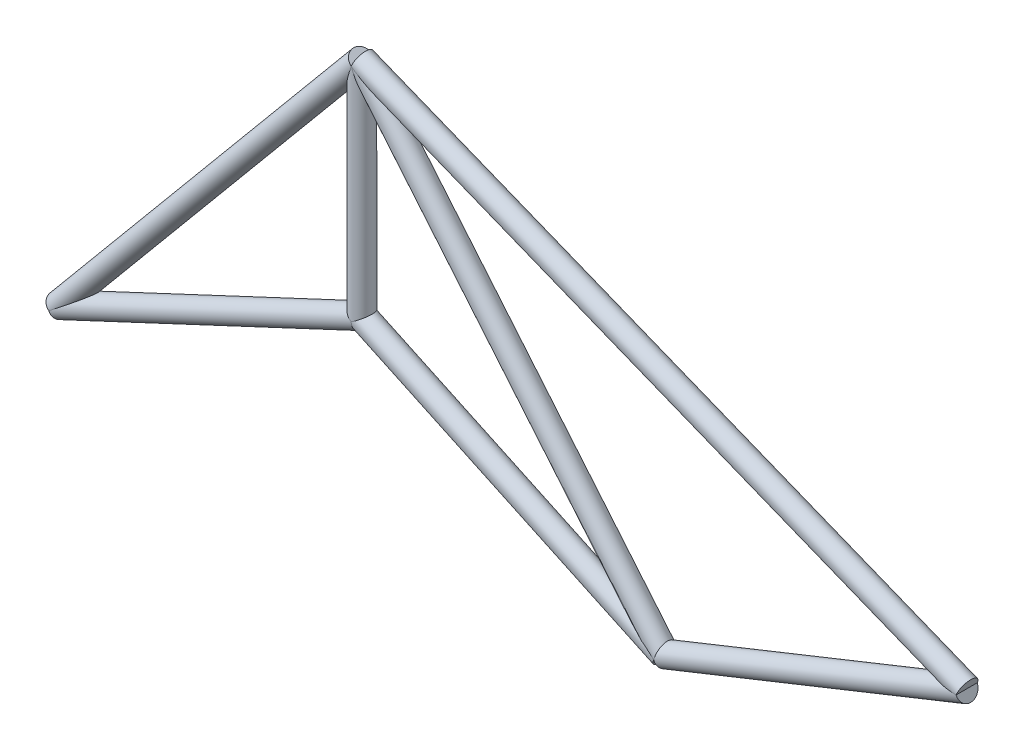
ISO-10303-21;
HEADER;
FILE_DESCRIPTION(('STEP AP214'),'2;1');
FILE_NAME('part.step','',(''),(''),'','','');
FILE_SCHEMA(('AUTOMOTIVE_DESIGN { 1 0 10303 214 1 1 1 1 }'));
ENDSEC;
DATA;
#1=APPLICATION_CONTEXT('core data for automotive mechanical design processes');
#2=APPLICATION_PROTOCOL_DEFINITION('international standard','automotive_design',2000,#1);
#3=PRODUCT_CONTEXT('',#1,'mechanical');
#4=PRODUCT('Part','Part','',(#3));
#5=PRODUCT_RELATED_PRODUCT_CATEGORY('part','',(#4));
#6=PRODUCT_DEFINITION_FORMATION('','',#4);
#7=PRODUCT_DEFINITION_CONTEXT('part definition',#1,'design');
#8=PRODUCT_DEFINITION('design','',#6,#7);
#9=PRODUCT_DEFINITION_SHAPE('','',#8);
#10=(LENGTH_UNIT() NAMED_UNIT(*) SI_UNIT(.MILLI.,.METRE.));
#11=(NAMED_UNIT(*) PLANE_ANGLE_UNIT() SI_UNIT($,.RADIAN.));
#12=(NAMED_UNIT(*) SI_UNIT($,.STERADIAN.) SOLID_ANGLE_UNIT());
#13=UNCERTAINTY_MEASURE_WITH_UNIT(LENGTH_MEASURE(1.E-05),#10,'distance_accuracy_value','');
#14=(GEOMETRIC_REPRESENTATION_CONTEXT(3) GLOBAL_UNCERTAINTY_ASSIGNED_CONTEXT((#13)) GLOBAL_UNIT_ASSIGNED_CONTEXT((#10,
#11,#12)) REPRESENTATION_CONTEXT('',''));
#15=CARTESIAN_POINT('',(0.,0.,0.));
#16=DIRECTION('',(0.,0.,1.));
#17=DIRECTION('',(1.,0.,0.));
#18=AXIS2_PLACEMENT_3D('',#15,#16,#17);
#19=CARTESIAN_POINT('',(2540.,1189.67236280048,0.));
#20=DIRECTION('',(0.,1.,0.));
#21=DIRECTION('',(-1.,0.,0.));
#22=AXIS2_PLACEMENT_3D('',#19,#20,#21);
#23=CYLINDRICAL_SURFACE('',#22,88.9);
#24=CARTESIAN_POINT('',(2540.,3048.,0.));
#25=DIRECTION('',(0.828067230469273,0.560628809305184,0.));
#26=DIRECTION('',(-0.560628809305184,0.828067230469273,0.));
#27=AXIS2_PLACEMENT_3D('',#24,#25,#26);
#28=ELLIPSE('',#27,158.571943725436,88.9);
#29=CARTESIAN_POINT('',(2540.,3048.,88.9));
#30=VERTEX_POINT('',#29);
#31=CARTESIAN_POINT('',(2540.,3048.,-88.9));
#32=VERTEX_POINT('',#31);
#33=EDGE_CURVE('E90',#30,#32,#28,.T.);
#34=ORIENTED_EDGE('',*,*,#33,.F.);
#35=CARTESIAN_POINT('',(2540.,3048.,0.));
#36=DIRECTION('',(-0.940271577683112,0.340425263753018,0.));
#37=DIRECTION('',(0.340425263753018,0.940271577683112,0.));
#38=AXIS2_PLACEMENT_3D('',#35,#36,#37);
#39=ELLIPSE('',#38,261.143955709755,88.9);
#40=EDGE_CURVE('E82',#32,#30,#39,.T.);
#41=ORIENTED_EDGE('',*,*,#40,.F.);
#42=EDGE_LOOP('',(#34,#41));
#43=FACE_BOUND('',#42,.T.);
#44=CARTESIAN_POINT('',(2540.,1189.67236280048,0.));
#45=DIRECTION('',(-0.536583918763075,0.843846963687647,0.));
#46=DIRECTION('',(0.843846963687647,0.536583918763075,0.));
#47=AXIS2_PLACEMENT_3D('',#44,#45,#46);
#48=ELLIPSE('',#47,105.350856050371,88.9);
#49=CARTESIAN_POINT('',(2540.,1189.67236280048,-88.9));
#50=VERTEX_POINT('',#49);
#51=CARTESIAN_POINT('',(2540.,1189.67236280048,88.9));
#52=VERTEX_POINT('',#51);
#53=EDGE_CURVE('E86',#50,#52,#48,.F.);
#54=ORIENTED_EDGE('',*,*,#53,.F.);
#55=CARTESIAN_POINT('',(2540.,1189.67236280048,0.));
#56=DIRECTION('',(0.536583918763075,0.843846963687648,0.));
#57=DIRECTION('',(-0.843846963687648,0.536583918763075,0.));
#58=AXIS2_PLACEMENT_3D('',#55,#56,#57);
#59=ELLIPSE('',#58,105.350856050371,88.9);
#60=EDGE_CURVE('E13',#52,#50,#59,.F.);
#61=ORIENTED_EDGE('',*,*,#60,.F.);
#62=EDGE_LOOP('',(#54,#61));
#63=FACE_BOUND('',#62,.T.);
#64=ADVANCED_FACE('F56',(#43,#63),#23,.T.);
#65=CARTESIAN_POINT('',(7620.,1016.,0.));
#66=DIRECTION('',(-0.928476690885259,0.371390676354104,0.));
#67=DIRECTION('',(-0.371390676354104,-0.928476690885259,0.));
#68=AXIS2_PLACEMENT_3D('',#65,#66,#67);
#69=CYLINDRICAL_SURFACE('',#68,88.9);
#70=ORIENTED_EDGE('',*,*,#33,.T.);
#71=CARTESIAN_POINT('',(2540.,3048.,0.));
#72=DIRECTION('',(-0.969460291496286,-0.245248329682256,0.));
#73=DIRECTION('',(-0.245248329682256,0.969460291496286,0.));
#74=AXIS2_PLACEMENT_3D('',#71,#72,#73);
#75=ELLIPSE('',#74,109.883543913002,88.9);
#76=EDGE_CURVE('E79',#32,#30,#75,.T.);
#77=ORIENTED_EDGE('',*,*,#76,.T.);
#78=EDGE_LOOP('',(#70,#77));
#79=FACE_BOUND('',#78,.T.);
#80=ADVANCED_FACE('F89',(#79),#69,.F.);
#81=CARTESIAN_POINT('',(2540.,3048.,0.));
#82=DIRECTION('',(-0.64018439966448,-0.768221279597376,0.));
#83=DIRECTION('',(0.768221279597376,-0.64018439966448,0.));
#84=AXIS2_PLACEMENT_3D('',#81,#82,#83);
#85=CYLINDRICAL_SURFACE('',#84,88.9);
#86=ORIENTED_EDGE('',*,*,#40,.T.);
#87=ORIENTED_EDGE('',*,*,#76,.F.);
#88=EDGE_LOOP('',(#86,#87));
#89=FACE_BOUND('',#88,.T.);
#90=ADVANCED_FACE('F83',(#89),#85,.F.);
#91=CARTESIAN_POINT('',(2540.,1189.67236280048,0.));
#92=DIRECTION('',(0.90558942122368,-0.424155396249724,0.));
#93=DIRECTION('',(0.424155396249724,0.90558942122368,0.));
#94=AXIS2_PLACEMENT_3D('',#91,#92,#93);
#95=CYLINDRICAL_SURFACE('',#94,88.9);
#96=ORIENTED_EDGE('',*,*,#53,.T.);
#97=CARTESIAN_POINT('',(2540.,1189.67236280048,0.));
#98=DIRECTION('',(-1.,0.,0.));
#99=DIRECTION('',(0.,-1.,0.));
#100=AXIS2_PLACEMENT_3D('',#97,#98,#99);
#101=ELLIPSE('',#100,98.1681078825696,88.9);
#102=EDGE_CURVE('E60',#52,#50,#101,.T.);
#103=ORIENTED_EDGE('',*,*,#102,.T.);
#104=EDGE_LOOP('',(#96,#103));
#105=FACE_BOUND('',#104,.T.);
#106=ADVANCED_FACE('F58',(#105),#95,.F.);
#107=CARTESIAN_POINT('',(0.,0.,0.));
#108=DIRECTION('',(0.90558942122368,0.424155396249724,0.));
#109=DIRECTION('',(-0.424155396249724,0.90558942122368,0.));
#110=AXIS2_PLACEMENT_3D('',#107,#108,#109);
#111=CYLINDRICAL_SURFACE('',#110,88.9);
#112=ORIENTED_EDGE('',*,*,#60,.T.);
#113=ORIENTED_EDGE('',*,*,#102,.F.);
#114=EDGE_LOOP('',(#112,#113));
#115=FACE_BOUND('',#114,.T.);
#116=ADVANCED_FACE('F97',(#115),#111,.F.);
#117=CLOSED_SHELL('',(#64,#80,#90,#106,#116));
#118=MANIFOLD_SOLID_BREP('B2',#117);
#119=CARTESIAN_POINT('',(5080.,0.,0.));
#120=DIRECTION('',(0.928476690885259,0.371390676354104,0.));
#121=DIRECTION('',(-0.371390676354104,0.928476690885259,0.));
#122=AXIS2_PLACEMENT_3D('',#119,#120,#121);
#123=CYLINDRICAL_SURFACE('',#122,88.9);
#124=CARTESIAN_POINT('',(5080.,-2.22044604925031E-13,0.));
#125=DIRECTION('',(0.969460291496286,-0.245248329682256,0.));
#126=DIRECTION('',(-0.245248329682256,-0.969460291496286,0.));
#127=AXIS2_PLACEMENT_3D('',#124,#125,#126);
#128=ELLIPSE('',#127,109.883543913002,88.9);
#129=CARTESIAN_POINT('',(5080.,-2.22044604925031E-13,-88.9));
#130=VERTEX_POINT('',#129);
#131=CARTESIAN_POINT('',(5080.,-2.22044604925031E-13,88.9));
#132=VERTEX_POINT('',#131);
#133=EDGE_CURVE('E207',#130,#132,#128,.T.);
#134=ORIENTED_EDGE('',*,*,#133,.T.);
#135=CARTESIAN_POINT('',(5080.,4.44089209850063E-13,0.));
#136=DIRECTION('',(0.999586421629187,-0.0287573589635115,0.));
#137=DIRECTION('',(-0.0287573589635115,-0.999586421629187,0.));
#138=AXIS2_PLACEMENT_3D('',#135,#136,#137);
#139=ELLIPSE('',#138,96.9029767205649,88.9);
#140=EDGE_CURVE('E198',#130,#132,#139,.T.);
#141=ORIENTED_EDGE('',*,*,#140,.F.);
#142=EDGE_LOOP('',(#134,#141));
#143=FACE_BOUND('',#142,.T.);
#144=ADVANCED_FACE('F178',(#143),#123,.F.);
#145=CARTESIAN_POINT('',(2540.,1189.67236280048,0.));
#146=DIRECTION('',(0.90558942122368,-0.424155396249724,0.));
#147=DIRECTION('',(0.424155396249724,0.90558942122368,0.));
#148=AXIS2_PLACEMENT_3D('',#145,#146,#147);
#149=CYLINDRICAL_SURFACE('',#148,88.9);
#150=CARTESIAN_POINT('',(5080.,1.33226762955019E-12,0.));
#151=DIRECTION('',(-0.61077859379914,-0.791801433035294,0.));
#152=DIRECTION('',(0.791801433035294,-0.61077859379914,0.));
#153=AXIS2_PLACEMENT_3D('',#150,#151,#152);
#154=ELLIPSE('',#153,409.172491686499,88.9);
#155=EDGE_CURVE('E210',#132,#130,#154,.T.);
#156=ORIENTED_EDGE('',*,*,#155,.T.);
#157=ORIENTED_EDGE('',*,*,#140,.T.);
#158=EDGE_LOOP('',(#156,#157));
#159=FACE_BOUND('',#158,.T.);
#160=ADVANCED_FACE('F180',(#159),#149,.F.);
#161=CARTESIAN_POINT('',(2540.,3048.,0.));
#162=DIRECTION('',(0.64018439966448,-0.768221279597376,0.));
#163=DIRECTION('',(0.768221279597376,0.64018439966448,0.));
#164=AXIS2_PLACEMENT_3D('',#161,#162,#163);
#165=CYLINDRICAL_SURFACE('',#164,88.9);
#166=ORIENTED_EDGE('',*,*,#155,.F.);
#167=ORIENTED_EDGE('',*,*,#133,.F.);
#168=EDGE_LOOP('',(#166,#167));
#169=FACE_BOUND('',#168,.T.);
#170=CARTESIAN_POINT('',(2539.99999999999,3048.00000000001,0.));
#171=DIRECTION('',(-0.58775587094577,-0.809038340357723,0.));
#172=DIRECTION('',(0.809038340357723,-0.58775587094577,0.));
#173=AXIS2_PLACEMENT_3D('',#170,#171,#172);
#174=ELLIPSE('',#173,362.489726699379,88.9);
#175=CARTESIAN_POINT('',(2540.,3048.,88.9));
#176=VERTEX_POINT('',#175);
#177=CARTESIAN_POINT('',(2540.,3048.,-88.9));
#178=VERTEX_POINT('',#177);
#179=EDGE_CURVE('E54',#176,#178,#174,.F.);
#180=ORIENTED_EDGE('',*,*,#179,.F.);
#181=CARTESIAN_POINT('',(2540.,3048.,0.));
#182=DIRECTION('',(1.,0.,0.));
#183=DIRECTION('',(0.,-1.,0.));
#184=AXIS2_PLACEMENT_3D('',#181,#182,#183);
#185=ELLIPSE('',#184,138.86623923762,88.9);
#186=EDGE_CURVE('E186',#178,#176,#185,.F.);
#187=ORIENTED_EDGE('',*,*,#186,.F.);
#188=EDGE_LOOP('',(#180,#187));
#189=FACE_BOUND('',#188,.T.);
#190=ADVANCED_FACE('F212',(#169,#189),#165,.T.);
#191=CARTESIAN_POINT('',(2540.,3048.,0.));
#192=DIRECTION('',(-0.64018439966448,-0.768221279597376,0.));
#193=DIRECTION('',(0.768221279597376,-0.64018439966448,0.));
#194=AXIS2_PLACEMENT_3D('',#191,#192,#193);
#195=CYLINDRICAL_SURFACE('',#194,88.9);
#196=ORIENTED_EDGE('',*,*,#186,.T.);
#197=CARTESIAN_POINT('',(2540.,3048.,0.));
#198=DIRECTION('',(-0.969460291496286,-0.245248329682256,0.));
#199=DIRECTION('',(-0.245248329682256,0.969460291496286,0.));
#200=AXIS2_PLACEMENT_3D('',#197,#198,#199);
#201=ELLIPSE('',#200,109.883543913002,88.9);
#202=EDGE_CURVE('E192',#178,#176,#201,.T.);
#203=ORIENTED_EDGE('',*,*,#202,.F.);
#204=EDGE_LOOP('',(#196,#203));
#205=FACE_BOUND('',#204,.T.);
#206=ADVANCED_FACE('F204',(#205),#195,.F.);
#207=CARTESIAN_POINT('',(7620.,1016.,0.));
#208=DIRECTION('',(-0.928476690885259,0.371390676354104,0.));
#209=DIRECTION('',(-0.371390676354104,-0.928476690885259,0.));
#210=AXIS2_PLACEMENT_3D('',#207,#208,#209);
#211=CYLINDRICAL_SURFACE('',#210,88.9);
#212=ORIENTED_EDGE('',*,*,#179,.T.);
#213=ORIENTED_EDGE('',*,*,#202,.T.);
#214=EDGE_LOOP('',(#212,#213));
#215=FACE_BOUND('',#214,.T.);
#216=ADVANCED_FACE('F209',(#215),#211,.F.);
#217=CLOSED_SHELL('',(#144,#160,#190,#206,#216));
#218=MANIFOLD_SOLID_BREP('B7',#217);
#219=CARTESIAN_POINT('',(2540.,1189.67236280048,0.));
#220=DIRECTION('',(0.90558942122368,-0.424155396249724,0.));
#221=DIRECTION('',(0.424155396249724,0.90558942122368,0.));
#222=AXIS2_PLACEMENT_3D('',#219,#220,#221);
#223=CYLINDRICAL_SURFACE('',#222,88.9);
#224=CARTESIAN_POINT('',(2540.,1189.67236280048,0.));
#225=DIRECTION('',(-0.90558942122368,0.424155396249723,0.));
#226=DIRECTION('',(-0.424155396249724,-0.905589421223681,0.));
#227=AXIS2_PLACEMENT_3D('',#224,#225,#226);
#228=CIRCLE('',#227,88.9);
#229=CARTESIAN_POINT('',(2502.2925852734,1109.1654632537,0.));
#230=VERTEX_POINT('',#229);
#231=EDGE_CURVE('E177',#230,#230,#228,.T.);
#232=ORIENTED_EDGE('',*,*,#231,.F.);
#233=EDGE_LOOP('',(#232));
#234=FACE_BOUND('',#233,.T.);
#235=CARTESIAN_POINT('',(5080.,2.22044604925031E-13,0.));
#236=DIRECTION('',(-0.90558942122368,0.424155396249723,0.));
#237=DIRECTION('',(-0.424155396249724,-0.905589421223681,0.));
#238=AXIS2_PLACEMENT_3D('',#235,#236,#237);
#239=CIRCLE('',#238,88.9);
#240=CARTESIAN_POINT('',(5042.2925852734,-80.506899546785,0.));
#241=VERTEX_POINT('',#240);
#242=EDGE_CURVE('E303',#241,#241,#239,.T.);
#243=ORIENTED_EDGE('',*,*,#242,.T.);
#244=EDGE_LOOP('',(#243));
#245=FACE_BOUND('',#244,.T.);
#246=ADVANCED_FACE('F300',(#234,#245),#223,.T.);
#247=CARTESIAN_POINT('',(2540.,1189.67236280048,0.));
#248=DIRECTION('',(-0.90558942122368,0.424155396249723,0.));
#249=DIRECTION('',(-0.424155396249724,-0.905589421223681,0.));
#250=AXIS2_PLACEMENT_3D('',#247,#248,#249);
#251=PLANE('',#250);
#252=ORIENTED_EDGE('',*,*,#231,.T.);
#253=EDGE_LOOP('',(#252));
#254=FACE_BOUND('',#253,.T.);
#255=ADVANCED_FACE('F315',(#254),#251,.T.);
#256=CARTESIAN_POINT('',(5080.,2.22044604925031E-13,0.));
#257=DIRECTION('',(-0.90558942122368,0.424155396249723,0.));
#258=DIRECTION('',(-0.424155396249724,-0.905589421223681,0.));
#259=AXIS2_PLACEMENT_3D('',#256,#257,#258);
#260=PLANE('',#259);
#261=ORIENTED_EDGE('',*,*,#242,.F.);
#262=EDGE_LOOP('',(#261));
#263=FACE_BOUND('',#262,.T.);
#264=ADVANCED_FACE('F313',(#263),#260,.F.);
#265=CLOSED_SHELL('',(#246,#255,#264));
#266=MANIFOLD_SOLID_BREP('B48',#265);
#267=CARTESIAN_POINT('',(5080.,0.,0.));
#268=DIRECTION('',(0.928476690885259,0.371390676354104,0.));
#269=DIRECTION('',(-0.371390676354104,0.928476690885259,0.));
#270=AXIS2_PLACEMENT_3D('',#267,#268,#269);
#271=CYLINDRICAL_SURFACE('',#270,88.9);
#272=CARTESIAN_POINT('',(5080.,0.,0.));
#273=DIRECTION('',(-0.928476690885259,-0.371390676354104,0.));
#274=DIRECTION('',(0.371390676354104,-0.928476690885259,0.));
#275=AXIS2_PLACEMENT_3D('',#272,#273,#274);
#276=CIRCLE('',#275,88.9);
#277=CARTESIAN_POINT('',(5113.01663112788,-82.5415778196996,0.));
#278=VERTEX_POINT('',#277);
#279=EDGE_CURVE('E299',#278,#278,#276,.T.);
#280=ORIENTED_EDGE('',*,*,#279,.F.);
#281=EDGE_LOOP('',(#280));
#282=FACE_BOUND('',#281,.T.);
#283=CARTESIAN_POINT('',(7620.,1016.,0.));
#284=DIRECTION('',(-0.928476690885259,-0.371390676354104,0.));
#285=DIRECTION('',(0.371390676354104,-0.928476690885259,0.));
#286=AXIS2_PLACEMENT_3D('',#283,#284,#285);
#287=CIRCLE('',#286,88.9);
#288=CARTESIAN_POINT('',(7653.01663112788,933.4584221803,0.));
#289=VERTEX_POINT('',#288);
#290=EDGE_CURVE('E357',#289,#289,#287,.T.);
#291=ORIENTED_EDGE('',*,*,#290,.T.);
#292=EDGE_LOOP('',(#291));
#293=FACE_BOUND('',#292,.T.);
#294=ADVANCED_FACE('F354',(#282,#293),#271,.T.);
#295=CARTESIAN_POINT('',(5080.,0.,0.));
#296=DIRECTION('',(-0.928476690885259,-0.371390676354104,0.));
#297=DIRECTION('',(0.371390676354104,-0.928476690885259,0.));
#298=AXIS2_PLACEMENT_3D('',#295,#296,#297);
#299=PLANE('',#298);
#300=ORIENTED_EDGE('',*,*,#279,.T.);
#301=EDGE_LOOP('',(#300));
#302=FACE_BOUND('',#301,.T.);
#303=ADVANCED_FACE('F369',(#302),#299,.T.);
#304=CARTESIAN_POINT('',(7620.,1016.,0.));
#305=DIRECTION('',(-0.928476690885259,-0.371390676354104,0.));
#306=DIRECTION('',(0.371390676354104,-0.928476690885259,0.));
#307=AXIS2_PLACEMENT_3D('',#304,#305,#306);
#308=PLANE('',#307);
#309=ORIENTED_EDGE('',*,*,#290,.F.);
#310=EDGE_LOOP('',(#309));
#311=FACE_BOUND('',#310,.T.);
#312=ADVANCED_FACE('F367',(#311),#308,.F.);
#313=CLOSED_SHELL('',(#294,#303,#312));
#314=MANIFOLD_SOLID_BREP('B172',#313);
#315=CARTESIAN_POINT('',(7620.,1016.,0.));
#316=DIRECTION('',(-0.928476690885259,0.371390676354104,0.));
#317=DIRECTION('',(-0.371390676354104,-0.928476690885259,0.));
#318=AXIS2_PLACEMENT_3D('',#315,#316,#317);
#319=CYLINDRICAL_SURFACE('',#318,88.9);
#320=CARTESIAN_POINT('',(7620.,1016.,0.));
#321=DIRECTION('',(0.928476690885259,-0.371390676354104,0.));
#322=DIRECTION('',(0.371390676354104,0.928476690885259,0.));
#323=AXIS2_PLACEMENT_3D('',#320,#321,#322);
#324=CIRCLE('',#323,88.9);
#325=CARTESIAN_POINT('',(7653.01663112788,1098.5415778197,0.));
#326=VERTEX_POINT('',#325);
#327=EDGE_CURVE('E353',#326,#326,#324,.T.);
#328=ORIENTED_EDGE('',*,*,#327,.F.);
#329=EDGE_LOOP('',(#328));
#330=FACE_BOUND('',#329,.T.);
#331=CARTESIAN_POINT('',(2540.,3048.,0.));
#332=DIRECTION('',(0.928476690885259,-0.371390676354104,0.));
#333=DIRECTION('',(0.371390676354104,0.928476690885259,0.));
#334=AXIS2_PLACEMENT_3D('',#331,#332,#333);
#335=CIRCLE('',#334,88.9);
#336=CARTESIAN_POINT('',(2573.01663112788,3130.5415778197,0.));
#337=VERTEX_POINT('',#336);
#338=EDGE_CURVE('E411',#337,#337,#335,.T.);
#339=ORIENTED_EDGE('',*,*,#338,.T.);
#340=EDGE_LOOP('',(#339));
#341=FACE_BOUND('',#340,.T.);
#342=ADVANCED_FACE('F408',(#330,#341),#319,.T.);
#343=CARTESIAN_POINT('',(7620.,1016.,0.));
#344=DIRECTION('',(0.928476690885259,-0.371390676354104,0.));
#345=DIRECTION('',(0.371390676354104,0.928476690885259,0.));
#346=AXIS2_PLACEMENT_3D('',#343,#344,#345);
#347=PLANE('',#346);
#348=ORIENTED_EDGE('',*,*,#327,.T.);
#349=EDGE_LOOP('',(#348));
#350=FACE_BOUND('',#349,.T.);
#351=ADVANCED_FACE('F423',(#350),#347,.T.);
#352=CARTESIAN_POINT('',(2540.,3048.,0.));
#353=DIRECTION('',(0.928476690885259,-0.371390676354104,0.));
#354=DIRECTION('',(0.371390676354104,0.928476690885259,0.));
#355=AXIS2_PLACEMENT_3D('',#352,#353,#354);
#356=PLANE('',#355);
#357=ORIENTED_EDGE('',*,*,#338,.F.);
#358=EDGE_LOOP('',(#357));
#359=FACE_BOUND('',#358,.T.);
#360=ADVANCED_FACE('F421',(#359),#356,.F.);
#361=CLOSED_SHELL('',(#342,#351,#360));
#362=MANIFOLD_SOLID_BREP('B294',#361);
#363=CARTESIAN_POINT('',(2540.,3048.,0.));
#364=DIRECTION('',(-0.64018439966448,-0.768221279597376,0.));
#365=DIRECTION('',(0.768221279597376,-0.64018439966448,0.));
#366=AXIS2_PLACEMENT_3D('',#363,#364,#365);
#367=CYLINDRICAL_SURFACE('',#366,88.9);
#368=CARTESIAN_POINT('',(2540.,3048.,0.));
#369=DIRECTION('',(0.64018439966448,0.768221279597376,0.));
#370=DIRECTION('',(-0.768221279597376,0.64018439966448,0.));
#371=AXIS2_PLACEMENT_3D('',#368,#369,#370);
#372=CIRCLE('',#371,88.9);
#373=CARTESIAN_POINT('',(2471.70512824379,3104.91239313017,0.));
#374=VERTEX_POINT('',#373);
#375=EDGE_CURVE('E407',#374,#374,#372,.T.);
#376=ORIENTED_EDGE('',*,*,#375,.F.);
#377=EDGE_LOOP('',(#376));
#378=FACE_BOUND('',#377,.T.);
#379=CARTESIAN_POINT('',(0.,0.,0.));
#380=DIRECTION('',(0.64018439966448,0.768221279597376,0.));
#381=DIRECTION('',(-0.768221279597376,0.64018439966448,0.));
#382=AXIS2_PLACEMENT_3D('',#379,#380,#381);
#383=CIRCLE('',#382,88.9);
#384=CARTESIAN_POINT('',(-68.2948717562067,56.9123931301722,0.));
#385=VERTEX_POINT('',#384);
#386=EDGE_CURVE('E464',#385,#385,#383,.T.);
#387=ORIENTED_EDGE('',*,*,#386,.T.);
#388=EDGE_LOOP('',(#387));
#389=FACE_BOUND('',#388,.T.);
#390=ADVANCED_FACE('F461',(#378,#389),#367,.T.);
#391=CARTESIAN_POINT('',(2540.,3048.,0.));
#392=DIRECTION('',(0.64018439966448,0.768221279597376,0.));
#393=DIRECTION('',(-0.768221279597376,0.64018439966448,0.));
#394=AXIS2_PLACEMENT_3D('',#391,#392,#393);
#395=PLANE('',#394);
#396=ORIENTED_EDGE('',*,*,#375,.T.);
#397=EDGE_LOOP('',(#396));
#398=FACE_BOUND('',#397,.T.);
#399=ADVANCED_FACE('F476',(#398),#395,.T.);
#400=CARTESIAN_POINT('',(0.,0.,0.));
#401=DIRECTION('',(0.64018439966448,0.768221279597376,0.));
#402=DIRECTION('',(-0.768221279597376,0.64018439966448,0.));
#403=AXIS2_PLACEMENT_3D('',#400,#401,#402);
#404=PLANE('',#403);
#405=ORIENTED_EDGE('',*,*,#386,.F.);
#406=EDGE_LOOP('',(#405));
#407=FACE_BOUND('',#406,.T.);
#408=ADVANCED_FACE('F474',(#407),#404,.F.);
#409=CLOSED_SHELL('',(#390,#399,#408));
#410=MANIFOLD_SOLID_BREP('B348',#409);
#411=CARTESIAN_POINT('',(-4.44089209850063E-13,-1.11022302462516E-13,0.));
#412=DIRECTION('',(0.90558942122368,0.424155396249724,0.));
#413=DIRECTION('',(-0.424155396249724,0.90558942122368,0.));
#414=AXIS2_PLACEMENT_3D('',#411,#412,#413);
#415=CYLINDRICAL_SURFACE('',#414,88.9);
#416=CARTESIAN_POINT('',(-4.44089209850063E-13,-1.11022302462516E-13,0.));
#417=DIRECTION('',(-0.90558942122368,-0.424155396249724,0.));
#418=DIRECTION('',(0.424155396249724,-0.90558942122368,0.));
#419=AXIS2_PLACEMENT_3D('',#416,#417,#418);
#420=CIRCLE('',#419,88.9);
#421=CARTESIAN_POINT('',(37.7074147266,-80.5068995467853,0.));
#422=VERTEX_POINT('',#421);
#423=EDGE_CURVE('E460',#422,#422,#420,.T.);
#424=ORIENTED_EDGE('',*,*,#423,.F.);
#425=EDGE_LOOP('',(#424));
#426=FACE_BOUND('',#425,.T.);
#427=CARTESIAN_POINT('',(2540.,1189.67236280048,0.));
#428=DIRECTION('',(-0.90558942122368,-0.424155396249724,0.));
#429=DIRECTION('',(0.424155396249724,-0.90558942122368,0.));
#430=AXIS2_PLACEMENT_3D('',#427,#428,#429);
#431=CIRCLE('',#430,88.9);
#432=CARTESIAN_POINT('',(2577.7074147266,1109.1654632537,0.));
#433=VERTEX_POINT('',#432);
#434=EDGE_CURVE('E510',#433,#433,#431,.T.);
#435=ORIENTED_EDGE('',*,*,#434,.T.);
#436=EDGE_LOOP('',(#435));
#437=FACE_BOUND('',#436,.T.);
#438=ADVANCED_FACE('F507',(#426,#437),#415,.T.);
#439=CARTESIAN_POINT('',(-4.44089209850063E-13,-1.11022302462516E-13,0.));
#440=DIRECTION('',(-0.90558942122368,-0.424155396249724,0.));
#441=DIRECTION('',(0.424155396249724,-0.90558942122368,0.));
#442=AXIS2_PLACEMENT_3D('',#439,#440,#441);
#443=PLANE('',#442);
#444=ORIENTED_EDGE('',*,*,#423,.T.);
#445=EDGE_LOOP('',(#444));
#446=FACE_BOUND('',#445,.T.);
#447=ADVANCED_FACE('F522',(#446),#443,.T.);
#448=CARTESIAN_POINT('',(2540.,1189.67236280048,0.));
#449=DIRECTION('',(-0.90558942122368,-0.424155396249724,0.));
#450=DIRECTION('',(0.424155396249724,-0.90558942122368,0.));
#451=AXIS2_PLACEMENT_3D('',#448,#449,#450);
#452=PLANE('',#451);
#453=ORIENTED_EDGE('',*,*,#434,.F.);
#454=EDGE_LOOP('',(#453));
#455=FACE_BOUND('',#454,.T.);
#456=ADVANCED_FACE('F520',(#455),#452,.F.);
#457=CLOSED_SHELL('',(#438,#447,#456));
#458=MANIFOLD_SOLID_BREP('B402',#457);
#459=ADVANCED_BREP_SHAPE_REPRESENTATION('',(#18,#118,#218,#266,#314,#362,#410,#458),#14);
#460=SHAPE_DEFINITION_REPRESENTATION(#9,#459);
ENDSEC;
END-ISO-10303-21;
